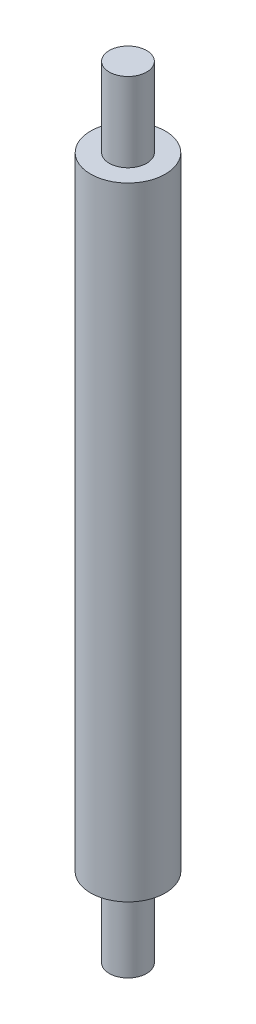
ISO-10303-21;
HEADER;
FILE_DESCRIPTION(('STEP AP214'),'2;1');
FILE_NAME('part.step','',(''),(''),'','','');
FILE_SCHEMA(('AUTOMOTIVE_DESIGN { 1 0 10303 214 1 1 1 1 }'));
ENDSEC;
DATA;
#1=APPLICATION_CONTEXT('core data for automotive mechanical design processes');
#2=APPLICATION_PROTOCOL_DEFINITION('international standard','automotive_design',2000,#1);
#3=PRODUCT_CONTEXT('',#1,'mechanical');
#4=PRODUCT('Part','Part','',(#3));
#5=PRODUCT_RELATED_PRODUCT_CATEGORY('part','',(#4));
#6=PRODUCT_DEFINITION_FORMATION('','',#4);
#7=PRODUCT_DEFINITION_CONTEXT('part definition',#1,'design');
#8=PRODUCT_DEFINITION('design','',#6,#7);
#9=PRODUCT_DEFINITION_SHAPE('','',#8);
#10=(LENGTH_UNIT() NAMED_UNIT(*) SI_UNIT(.MILLI.,.METRE.));
#11=(NAMED_UNIT(*) PLANE_ANGLE_UNIT() SI_UNIT($,.RADIAN.));
#12=(NAMED_UNIT(*) SI_UNIT($,.STERADIAN.) SOLID_ANGLE_UNIT());
#13=UNCERTAINTY_MEASURE_WITH_UNIT(LENGTH_MEASURE(1.E-05),#10,'distance_accuracy_value','');
#14=(GEOMETRIC_REPRESENTATION_CONTEXT(3) GLOBAL_UNCERTAINTY_ASSIGNED_CONTEXT((#13)) GLOBAL_UNIT_ASSIGNED_CONTEXT((#10,
#11,#12)) REPRESENTATION_CONTEXT('',''));
#15=CARTESIAN_POINT('',(0.,0.,0.));
#16=DIRECTION('',(0.,0.,1.));
#17=DIRECTION('',(1.,0.,0.));
#18=AXIS2_PLACEMENT_3D('',#15,#16,#17);
#19=CARTESIAN_POINT('',(0.,6.35,0.));
#20=DIRECTION('',(0.,-1.,0.));
#21=DIRECTION('',(0.,0.,-1.));
#22=AXIS2_PLACEMENT_3D('',#19,#20,#21);
#23=CYLINDRICAL_SURFACE('',#22,1.5);
#24=CARTESIAN_POINT('',(0.,6.35,0.));
#25=DIRECTION('',(0.,1.,0.));
#26=DIRECTION('',(0.,0.,1.));
#27=AXIS2_PLACEMENT_3D('',#24,#25,#26);
#28=CIRCLE('',#27,1.5);
#29=CARTESIAN_POINT('',(0.,6.35,1.5));
#30=VERTEX_POINT('',#29);
#31=EDGE_CURVE('E38',#30,#30,#28,.T.);
#32=ORIENTED_EDGE('',*,*,#31,.F.);
#33=EDGE_LOOP('',(#32));
#34=FACE_BOUND('',#33,.T.);
#35=CARTESIAN_POINT('',(0.,0.,0.));
#36=DIRECTION('',(0.,1.,0.));
#37=DIRECTION('',(0.,0.,1.));
#38=AXIS2_PLACEMENT_3D('',#35,#36,#37);
#39=CIRCLE('',#38,1.5);
#40=CARTESIAN_POINT('',(0.,0.,1.5));
#41=VERTEX_POINT('',#40);
#42=EDGE_CURVE('E34',#41,#41,#39,.T.);
#43=ORIENTED_EDGE('',*,*,#42,.T.);
#44=EDGE_LOOP('',(#43));
#45=FACE_BOUND('',#44,.T.);
#46=ADVANCED_FACE('F31',(#34,#45),#23,.T.);
#47=CARTESIAN_POINT('',(0.,0.,0.));
#48=DIRECTION('',(0.,1.,0.));
#49=DIRECTION('',(0.,0.,1.));
#50=AXIS2_PLACEMENT_3D('',#47,#48,#49);
#51=PLANE('',#50);
#52=ORIENTED_EDGE('',*,*,#42,.F.);
#53=EDGE_LOOP('',(#52));
#54=FACE_BOUND('',#53,.T.);
#55=ADVANCED_FACE('F72',(#54),#51,.F.);
#56=CARTESIAN_POINT('',(0.,56.35,0.));
#57=DIRECTION('',(0.,-1.,0.));
#58=DIRECTION('',(0.,0.,-1.));
#59=AXIS2_PLACEMENT_3D('',#56,#57,#58);
#60=CYLINDRICAL_SURFACE('',#59,3.);
#61=CARTESIAN_POINT('',(0.,56.35,0.));
#62=DIRECTION('',(0.,1.,0.));
#63=DIRECTION('',(0.,0.,1.));
#64=AXIS2_PLACEMENT_3D('',#61,#62,#63);
#65=CIRCLE('',#64,3.);
#66=CARTESIAN_POINT('',(0.,56.35,3.));
#67=VERTEX_POINT('',#66);
#68=EDGE_CURVE('E46',#67,#67,#65,.T.);
#69=ORIENTED_EDGE('',*,*,#68,.F.);
#70=EDGE_LOOP('',(#69));
#71=FACE_BOUND('',#70,.T.);
#72=CARTESIAN_POINT('',(0.,6.35,0.));
#73=DIRECTION('',(0.,1.,0.));
#74=DIRECTION('',(0.,0.,1.));
#75=AXIS2_PLACEMENT_3D('',#72,#73,#74);
#76=CIRCLE('',#75,3.);
#77=CARTESIAN_POINT('',(0.,6.35,3.));
#78=VERTEX_POINT('',#77);
#79=EDGE_CURVE('E49',#78,#78,#76,.T.);
#80=ORIENTED_EDGE('',*,*,#79,.T.);
#81=EDGE_LOOP('',(#80));
#82=FACE_BOUND('',#81,.T.);
#83=ADVANCED_FACE('F77',(#71,#82),#60,.T.);
#84=CARTESIAN_POINT('',(0.,56.35,0.));
#85=DIRECTION('',(0.,1.,0.));
#86=DIRECTION('',(0.,0.,1.));
#87=AXIS2_PLACEMENT_3D('',#84,#85,#86);
#88=PLANE('',#87);
#89=CARTESIAN_POINT('',(0.,56.35,0.));
#90=DIRECTION('',(0.,1.,0.));
#91=DIRECTION('',(0.,0.,1.));
#92=AXIS2_PLACEMENT_3D('',#89,#90,#91);
#93=CIRCLE('',#92,1.5);
#94=CARTESIAN_POINT('',(0.,56.35,1.5));
#95=VERTEX_POINT('',#94);
#96=EDGE_CURVE('E10',#95,#95,#93,.T.);
#97=ORIENTED_EDGE('',*,*,#96,.F.);
#98=EDGE_LOOP('',(#97));
#99=FACE_BOUND('',#98,.T.);
#100=ORIENTED_EDGE('',*,*,#68,.T.);
#101=EDGE_LOOP('',(#100));
#102=FACE_BOUND('',#101,.T.);
#103=ADVANCED_FACE('F67',(#99,#102),#88,.T.);
#104=CARTESIAN_POINT('',(0.,6.35,0.));
#105=DIRECTION('',(0.,1.,0.));
#106=DIRECTION('',(0.,0.,1.));
#107=AXIS2_PLACEMENT_3D('',#104,#105,#106);
#108=PLANE('',#107);
#109=ORIENTED_EDGE('',*,*,#31,.T.);
#110=EDGE_LOOP('',(#109));
#111=FACE_BOUND('',#110,.T.);
#112=ORIENTED_EDGE('',*,*,#79,.F.);
#113=EDGE_LOOP('',(#112));
#114=FACE_BOUND('',#113,.T.);
#115=ADVANCED_FACE('F60',(#111,#114),#108,.F.);
#116=CARTESIAN_POINT('',(0.,62.7,0.));
#117=DIRECTION('',(0.,-1.,0.));
#118=DIRECTION('',(0.,0.,-1.));
#119=AXIS2_PLACEMENT_3D('',#116,#117,#118);
#120=CYLINDRICAL_SURFACE('',#119,1.5);
#121=CARTESIAN_POINT('',(0.,62.7,0.));
#122=DIRECTION('',(0.,1.,0.));
#123=DIRECTION('',(0.,0.,1.));
#124=AXIS2_PLACEMENT_3D('',#121,#122,#123);
#125=CIRCLE('',#124,1.5);
#126=CARTESIAN_POINT('',(0.,62.7,1.5));
#127=VERTEX_POINT('',#126);
#128=EDGE_CURVE('E45',#127,#127,#125,.T.);
#129=ORIENTED_EDGE('',*,*,#128,.F.);
#130=EDGE_LOOP('',(#129));
#131=FACE_BOUND('',#130,.T.);
#132=ORIENTED_EDGE('',*,*,#96,.T.);
#133=EDGE_LOOP('',(#132));
#134=FACE_BOUND('',#133,.T.);
#135=ADVANCED_FACE('F58',(#131,#134),#120,.T.);
#136=CARTESIAN_POINT('',(0.,62.7,0.));
#137=DIRECTION('',(0.,1.,0.));
#138=DIRECTION('',(0.,0.,1.));
#139=AXIS2_PLACEMENT_3D('',#136,#137,#138);
#140=PLANE('',#139);
#141=ORIENTED_EDGE('',*,*,#128,.T.);
#142=EDGE_LOOP('',(#141));
#143=FACE_BOUND('',#142,.T.);
#144=ADVANCED_FACE('F56',(#143),#140,.T.);
#145=CLOSED_SHELL('',(#46,#55,#83,#103,#115,#135,#144));
#146=MANIFOLD_SOLID_BREP('B2',#145);
#147=ADVANCED_BREP_SHAPE_REPRESENTATION('',(#18,#146),#14);
#148=SHAPE_DEFINITION_REPRESENTATION(#9,#147);
ENDSEC;
END-ISO-10303-21;
